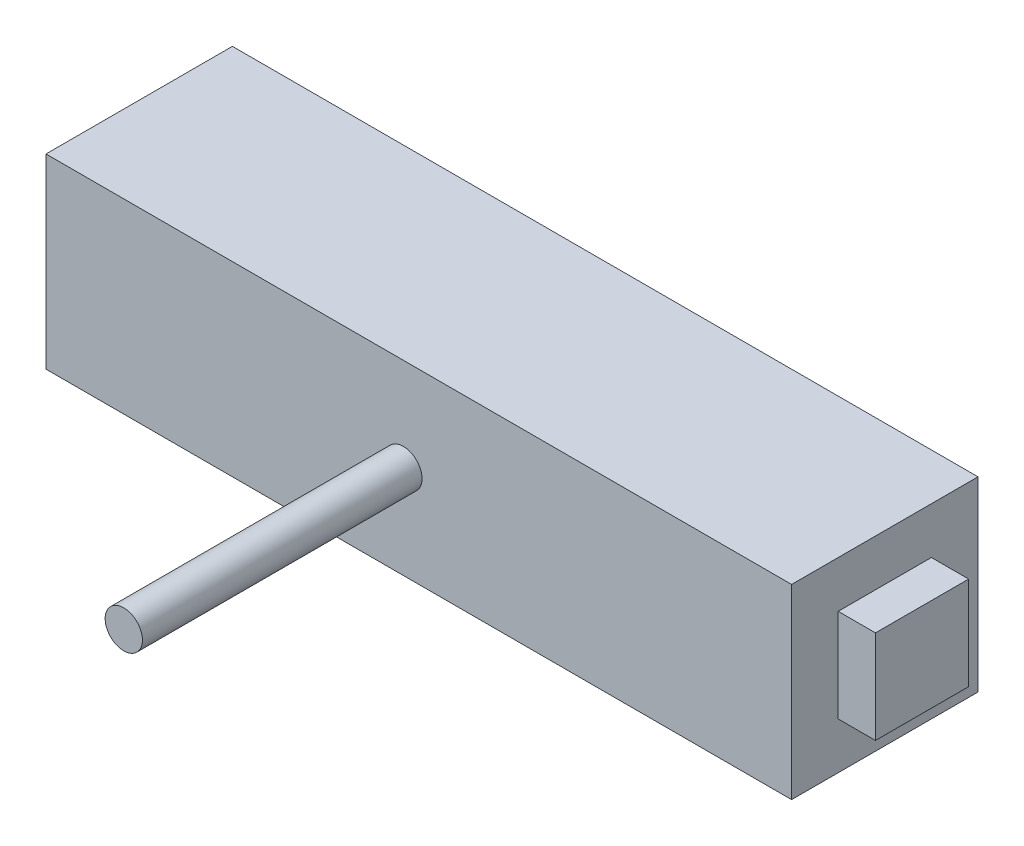
ISO-10303-21;
HEADER;
FILE_DESCRIPTION(('STEP AP214'),'2;1');
FILE_NAME('part.step','',(''),(''),'','','');
FILE_SCHEMA(('AUTOMOTIVE_DESIGN { 1 0 10303 214 1 1 1 1 }'));
ENDSEC;
DATA;
#1=APPLICATION_CONTEXT('core data for automotive mechanical design processes');
#2=APPLICATION_PROTOCOL_DEFINITION('international standard','automotive_design',2000,#1);
#3=PRODUCT_CONTEXT('',#1,'mechanical');
#4=PRODUCT('Part','Part','',(#3));
#5=PRODUCT_RELATED_PRODUCT_CATEGORY('part','',(#4));
#6=PRODUCT_DEFINITION_FORMATION('','',#4);
#7=PRODUCT_DEFINITION_CONTEXT('part definition',#1,'design');
#8=PRODUCT_DEFINITION('design','',#6,#7);
#9=PRODUCT_DEFINITION_SHAPE('','',#8);
#10=(LENGTH_UNIT() NAMED_UNIT(*) SI_UNIT(.MILLI.,.METRE.));
#11=(NAMED_UNIT(*) PLANE_ANGLE_UNIT() SI_UNIT($,.RADIAN.));
#12=(NAMED_UNIT(*) SI_UNIT($,.STERADIAN.) SOLID_ANGLE_UNIT());
#13=UNCERTAINTY_MEASURE_WITH_UNIT(LENGTH_MEASURE(1.E-05),#10,'distance_accuracy_value','');
#14=(GEOMETRIC_REPRESENTATION_CONTEXT(3) GLOBAL_UNCERTAINTY_ASSIGNED_CONTEXT((#13)) GLOBAL_UNIT_ASSIGNED_CONTEXT((#10,
#11,#12)) REPRESENTATION_CONTEXT('',''));
#15=CARTESIAN_POINT('',(0.,0.,0.));
#16=DIRECTION('',(0.,0.,1.));
#17=DIRECTION('',(1.,0.,0.));
#18=AXIS2_PLACEMENT_3D('',#15,#16,#17);
#19=CARTESIAN_POINT('',(50.8,25.4,-12.7));
#20=DIRECTION('',(-1.,0.,0.));
#21=DIRECTION('',(0.,0.,1.));
#22=AXIS2_PLACEMENT_3D('',#19,#20,#21);
#23=PLANE('',#22);
#24=DIRECTION('',(0.,0.,-1.));
#25=VECTOR('',#24,1.);
#26=CARTESIAN_POINT('',(50.8,0.,-12.7));
#27=LINE('',#26,#25);
#28=CARTESIAN_POINT('',(50.8,0.,12.7));
#29=VERTEX_POINT('',#28);
#30=CARTESIAN_POINT('',(50.8,0.,-12.7));
#31=VERTEX_POINT('',#30);
#32=EDGE_CURVE('E127',#29,#31,#27,.T.);
#33=ORIENTED_EDGE('',*,*,#32,.T.);
#34=DIRECTION('',(0.,-1.,0.));
#35=VECTOR('',#34,1.);
#36=CARTESIAN_POINT('',(50.8,25.4,-12.7));
#37=LINE('',#36,#35);
#38=CARTESIAN_POINT('',(50.8,25.4,-12.7));
#39=VERTEX_POINT('',#38);
#40=EDGE_CURVE('E47',#39,#31,#37,.T.);
#41=ORIENTED_EDGE('',*,*,#40,.F.);
#42=DIRECTION('',(0.,0.,-1.));
#43=VECTOR('',#42,1.);
#44=CARTESIAN_POINT('',(50.8,25.4,-12.7));
#45=LINE('',#44,#43);
#46=CARTESIAN_POINT('',(50.8,25.4,12.7));
#47=VERTEX_POINT('',#46);
#48=EDGE_CURVE('E138',#47,#39,#45,.T.);
#49=ORIENTED_EDGE('',*,*,#48,.F.);
#50=DIRECTION('',(0.,-1.,0.));
#51=VECTOR('',#50,1.);
#52=CARTESIAN_POINT('',(50.8,25.4,12.7));
#53=LINE('',#52,#51);
#54=EDGE_CURVE('E151',#47,#29,#53,.T.);
#55=ORIENTED_EDGE('',*,*,#54,.T.);
#56=EDGE_LOOP('',(#33,#41,#49,#55));
#57=FACE_BOUND('',#56,.T.);
#58=DIRECTION('',(0.,1.,0.));
#59=VECTOR('',#58,1.);
#60=CARTESIAN_POINT('',(50.8,19.05,-6.35));
#61=LINE('',#60,#59);
#62=CARTESIAN_POINT('',(50.8,6.35,-6.35));
#63=VERTEX_POINT('',#62);
#64=CARTESIAN_POINT('',(50.8,19.05,-6.35));
#65=VERTEX_POINT('',#64);
#66=EDGE_CURVE('E54',#63,#65,#61,.T.);
#67=ORIENTED_EDGE('',*,*,#66,.F.);
#68=DIRECTION('',(0.,0.,-1.));
#69=VECTOR('',#68,1.);
#70=CARTESIAN_POINT('',(50.8,6.35,6.35));
#71=LINE('',#70,#69);
#72=CARTESIAN_POINT('',(50.8,6.35,6.35));
#73=VERTEX_POINT('',#72);
#74=EDGE_CURVE('E58',#73,#63,#71,.T.);
#75=ORIENTED_EDGE('',*,*,#74,.F.);
#76=DIRECTION('',(0.,-1.,0.));
#77=VECTOR('',#76,1.);
#78=CARTESIAN_POINT('',(50.8,19.05,6.35));
#79=LINE('',#78,#77);
#80=CARTESIAN_POINT('',(50.8,19.05,6.35));
#81=VERTEX_POINT('',#80);
#82=EDGE_CURVE('E300',#81,#73,#79,.T.);
#83=ORIENTED_EDGE('',*,*,#82,.F.);
#84=DIRECTION('',(0.,0.,1.));
#85=VECTOR('',#84,1.);
#86=CARTESIAN_POINT('',(50.8,19.05,6.35));
#87=LINE('',#86,#85);
#88=EDGE_CURVE('E303',#65,#81,#87,.T.);
#89=ORIENTED_EDGE('',*,*,#88,.F.);
#90=EDGE_LOOP('',(#67,#75,#83,#89));
#91=FACE_BOUND('',#90,.T.);
#92=ADVANCED_FACE('F39',(#57,#91),#23,.F.);
#93=CARTESIAN_POINT('',(-50.8,25.4,-12.7));
#94=DIRECTION('',(0.,0.,1.));
#95=DIRECTION('',(1.,0.,0.));
#96=AXIS2_PLACEMENT_3D('',#93,#94,#95);
#97=PLANE('',#96);
#98=DIRECTION('',(-1.,0.,0.));
#99=VECTOR('',#98,1.);
#100=CARTESIAN_POINT('',(-50.8,0.,-12.7));
#101=LINE('',#100,#99);
#102=CARTESIAN_POINT('',(-50.8,0.,-12.7));
#103=VERTEX_POINT('',#102);
#104=EDGE_CURVE('E132',#31,#103,#101,.T.);
#105=ORIENTED_EDGE('',*,*,#104,.T.);
#106=DIRECTION('',(0.,-1.,0.));
#107=VECTOR('',#106,1.);
#108=CARTESIAN_POINT('',(-50.8,25.4,-12.7));
#109=LINE('',#108,#107);
#110=CARTESIAN_POINT('',(-50.8,25.4,-12.7));
#111=VERTEX_POINT('',#110);
#112=EDGE_CURVE('E167',#111,#103,#109,.T.);
#113=ORIENTED_EDGE('',*,*,#112,.F.);
#114=DIRECTION('',(-1.,0.,0.));
#115=VECTOR('',#114,1.);
#116=CARTESIAN_POINT('',(-50.8,25.4,-12.7));
#117=LINE('',#116,#115);
#118=EDGE_CURVE('E142',#39,#111,#117,.T.);
#119=ORIENTED_EDGE('',*,*,#118,.F.);
#120=ORIENTED_EDGE('',*,*,#40,.T.);
#121=EDGE_LOOP('',(#105,#113,#119,#120));
#122=FACE_BOUND('',#121,.T.);
#123=ADVANCED_FACE('F174',(#122),#97,.F.);
#124=CARTESIAN_POINT('',(-50.8,25.4,-12.7));
#125=DIRECTION('',(1.,0.,0.));
#126=DIRECTION('',(0.,0.,-1.));
#127=AXIS2_PLACEMENT_3D('',#124,#125,#126);
#128=PLANE('',#127);
#129=DIRECTION('',(0.,0.,1.));
#130=VECTOR('',#129,1.);
#131=CARTESIAN_POINT('',(-50.8,0.,-12.7));
#132=LINE('',#131,#130);
#133=CARTESIAN_POINT('',(-50.8,0.,12.7));
#134=VERTEX_POINT('',#133);
#135=EDGE_CURVE('E155',#103,#134,#132,.T.);
#136=ORIENTED_EDGE('',*,*,#135,.T.);
#137=DIRECTION('',(0.,-1.,0.));
#138=VECTOR('',#137,1.);
#139=CARTESIAN_POINT('',(-50.8,25.4,12.7));
#140=LINE('',#139,#138);
#141=CARTESIAN_POINT('',(-50.8,25.4,12.7));
#142=VERTEX_POINT('',#141);
#143=EDGE_CURVE('E163',#142,#134,#140,.T.);
#144=ORIENTED_EDGE('',*,*,#143,.F.);
#145=DIRECTION('',(0.,0.,1.));
#146=VECTOR('',#145,1.);
#147=CARTESIAN_POINT('',(-50.8,25.4,-12.7));
#148=LINE('',#147,#146);
#149=EDGE_CURVE('E146',#111,#142,#148,.T.);
#150=ORIENTED_EDGE('',*,*,#149,.F.);
#151=ORIENTED_EDGE('',*,*,#112,.T.);
#152=EDGE_LOOP('',(#136,#144,#150,#151));
#153=FACE_BOUND('',#152,.T.);
#154=ADVANCED_FACE('F186',(#153),#128,.F.);
#155=CARTESIAN_POINT('',(-50.8,25.4,12.7));
#156=DIRECTION('',(0.,0.,-1.));
#157=DIRECTION('',(-1.,0.,0.));
#158=AXIS2_PLACEMENT_3D('',#155,#156,#157);
#159=PLANE('',#158);
#160=CARTESIAN_POINT('',(-2.10107492424835,12.7,12.7));
#161=DIRECTION('',(0.,0.,-1.));
#162=DIRECTION('',(-1.,0.,0.));
#163=AXIS2_PLACEMENT_3D('',#160,#161,#162);
#164=CIRCLE('',#163,2.54);
#165=CARTESIAN_POINT('',(-4.64107492424835,12.7,12.7));
#166=VERTEX_POINT('',#165);
#167=EDGE_CURVE('E11',#166,#166,#164,.F.);
#168=ORIENTED_EDGE('',*,*,#167,.F.);
#169=EDGE_LOOP('',(#168));
#170=FACE_BOUND('',#169,.T.);
#171=DIRECTION('',(1.,0.,0.));
#172=VECTOR('',#171,1.);
#173=CARTESIAN_POINT('',(-50.8,0.,12.7));
#174=LINE('',#173,#172);
#175=EDGE_CURVE('E143',#134,#29,#174,.T.);
#176=ORIENTED_EDGE('',*,*,#175,.T.);
#177=ORIENTED_EDGE('',*,*,#54,.F.);
#178=DIRECTION('',(1.,0.,0.));
#179=VECTOR('',#178,1.);
#180=CARTESIAN_POINT('',(-50.8,25.4,12.7));
#181=LINE('',#180,#179);
#182=EDGE_CURVE('E149',#142,#47,#181,.T.);
#183=ORIENTED_EDGE('',*,*,#182,.F.);
#184=ORIENTED_EDGE('',*,*,#143,.T.);
#185=EDGE_LOOP('',(#176,#177,#183,#184));
#186=FACE_BOUND('',#185,.T.);
#187=ADVANCED_FACE('F190',(#170,#186),#159,.F.);
#188=CARTESIAN_POINT('',(0.,25.4,0.));
#189=DIRECTION('',(0.,1.,0.));
#190=DIRECTION('',(0.,0.,1.));
#191=AXIS2_PLACEMENT_3D('',#188,#189,#190);
#192=PLANE('',#191);
#193=ORIENTED_EDGE('',*,*,#48,.T.);
#194=ORIENTED_EDGE('',*,*,#118,.T.);
#195=ORIENTED_EDGE('',*,*,#149,.T.);
#196=ORIENTED_EDGE('',*,*,#182,.T.);
#197=EDGE_LOOP('',(#193,#194,#195,#196));
#198=FACE_BOUND('',#197,.T.);
#199=ADVANCED_FACE('F192',(#198),#192,.T.);
#200=CARTESIAN_POINT('',(0.,0.,0.));
#201=DIRECTION('',(0.,1.,0.));
#202=DIRECTION('',(0.,0.,1.));
#203=AXIS2_PLACEMENT_3D('',#200,#201,#202);
#204=PLANE('',#203);
#205=ORIENTED_EDGE('',*,*,#32,.F.);
#206=ORIENTED_EDGE('',*,*,#175,.F.);
#207=ORIENTED_EDGE('',*,*,#135,.F.);
#208=ORIENTED_EDGE('',*,*,#104,.F.);
#209=EDGE_LOOP('',(#205,#206,#207,#208));
#210=FACE_BOUND('',#209,.T.);
#211=ADVANCED_FACE('F182',(#210),#204,.F.);
#212=CARTESIAN_POINT('',(55.88,19.05,-6.35));
#213=DIRECTION('',(0.,0.,1.));
#214=DIRECTION('',(0.,-1.,0.));
#215=AXIS2_PLACEMENT_3D('',#212,#213,#214);
#216=PLANE('',#215);
#217=ORIENTED_EDGE('',*,*,#66,.T.);
#218=DIRECTION('',(-1.,0.,0.));
#219=VECTOR('',#218,1.);
#220=CARTESIAN_POINT('',(55.88,19.05,-6.35));
#221=LINE('',#220,#219);
#222=CARTESIAN_POINT('',(55.88,19.05,-6.35));
#223=VERTEX_POINT('',#222);
#224=EDGE_CURVE('E107',#223,#65,#221,.T.);
#225=ORIENTED_EDGE('',*,*,#224,.F.);
#226=DIRECTION('',(0.,1.,0.));
#227=VECTOR('',#226,1.);
#228=CARTESIAN_POINT('',(55.88,19.05,-6.35));
#229=LINE('',#228,#227);
#230=CARTESIAN_POINT('',(55.88,6.35,-6.35));
#231=VERTEX_POINT('',#230);
#232=EDGE_CURVE('E114',#231,#223,#229,.T.);
#233=ORIENTED_EDGE('',*,*,#232,.F.);
#234=DIRECTION('',(-1.,0.,0.));
#235=VECTOR('',#234,1.);
#236=CARTESIAN_POINT('',(55.88,6.35,-6.35));
#237=LINE('',#236,#235);
#238=EDGE_CURVE('E306',#231,#63,#237,.T.);
#239=ORIENTED_EDGE('',*,*,#238,.T.);
#240=EDGE_LOOP('',(#217,#225,#233,#239));
#241=FACE_BOUND('',#240,.T.);
#242=ADVANCED_FACE('F125',(#241),#216,.F.);
#243=CARTESIAN_POINT('',(55.88,19.05,6.35));
#244=DIRECTION('',(0.,-1.,0.));
#245=DIRECTION('',(0.,0.,-1.));
#246=AXIS2_PLACEMENT_3D('',#243,#244,#245);
#247=PLANE('',#246);
#248=ORIENTED_EDGE('',*,*,#88,.T.);
#249=DIRECTION('',(-1.,0.,0.));
#250=VECTOR('',#249,1.);
#251=CARTESIAN_POINT('',(55.88,19.05,6.35));
#252=LINE('',#251,#250);
#253=CARTESIAN_POINT('',(55.88,19.05,6.35));
#254=VERTEX_POINT('',#253);
#255=EDGE_CURVE('E109',#254,#81,#252,.T.);
#256=ORIENTED_EDGE('',*,*,#255,.F.);
#257=DIRECTION('',(0.,0.,1.));
#258=VECTOR('',#257,1.);
#259=CARTESIAN_POINT('',(55.88,19.05,6.35));
#260=LINE('',#259,#258);
#261=EDGE_CURVE('E102',#223,#254,#260,.T.);
#262=ORIENTED_EDGE('',*,*,#261,.F.);
#263=ORIENTED_EDGE('',*,*,#224,.T.);
#264=EDGE_LOOP('',(#248,#256,#262,#263));
#265=FACE_BOUND('',#264,.T.);
#266=ADVANCED_FACE('F105',(#265),#247,.F.);
#267=CARTESIAN_POINT('',(55.88,19.05,6.35));
#268=DIRECTION('',(0.,0.,-1.));
#269=DIRECTION('',(0.,1.,0.));
#270=AXIS2_PLACEMENT_3D('',#267,#268,#269);
#271=PLANE('',#270);
#272=ORIENTED_EDGE('',*,*,#82,.T.);
#273=DIRECTION('',(-1.,0.,0.));
#274=VECTOR('',#273,1.);
#275=CARTESIAN_POINT('',(55.88,6.35,6.35));
#276=LINE('',#275,#274);
#277=CARTESIAN_POINT('',(55.88,6.35,6.35));
#278=VERTEX_POINT('',#277);
#279=EDGE_CURVE('E134',#278,#73,#276,.T.);
#280=ORIENTED_EDGE('',*,*,#279,.F.);
#281=DIRECTION('',(0.,-1.,0.));
#282=VECTOR('',#281,1.);
#283=CARTESIAN_POINT('',(55.88,19.05,6.35));
#284=LINE('',#283,#282);
#285=EDGE_CURVE('E113',#254,#278,#284,.T.);
#286=ORIENTED_EDGE('',*,*,#285,.F.);
#287=ORIENTED_EDGE('',*,*,#255,.T.);
#288=EDGE_LOOP('',(#272,#280,#286,#287));
#289=FACE_BOUND('',#288,.T.);
#290=ADVANCED_FACE('F253',(#289),#271,.F.);
#291=CARTESIAN_POINT('',(55.88,6.35,6.35));
#292=DIRECTION('',(0.,1.,0.));
#293=DIRECTION('',(0.,0.,1.));
#294=AXIS2_PLACEMENT_3D('',#291,#292,#293);
#295=PLANE('',#294);
#296=ORIENTED_EDGE('',*,*,#74,.T.);
#297=ORIENTED_EDGE('',*,*,#238,.F.);
#298=DIRECTION('',(0.,0.,-1.));
#299=VECTOR('',#298,1.);
#300=CARTESIAN_POINT('',(55.88,6.35,6.35));
#301=LINE('',#300,#299);
#302=EDGE_CURVE('E119',#278,#231,#301,.T.);
#303=ORIENTED_EDGE('',*,*,#302,.F.);
#304=ORIENTED_EDGE('',*,*,#279,.T.);
#305=EDGE_LOOP('',(#296,#297,#303,#304));
#306=FACE_BOUND('',#305,.T.);
#307=ADVANCED_FACE('F250',(#306),#295,.F.);
#308=CARTESIAN_POINT('',(55.88,0.,0.));
#309=DIRECTION('',(1.,0.,0.));
#310=DIRECTION('',(0.,0.,-1.));
#311=AXIS2_PLACEMENT_3D('',#308,#309,#310);
#312=PLANE('',#311);
#313=ORIENTED_EDGE('',*,*,#232,.T.);
#314=ORIENTED_EDGE('',*,*,#261,.T.);
#315=ORIENTED_EDGE('',*,*,#285,.T.);
#316=ORIENTED_EDGE('',*,*,#302,.T.);
#317=EDGE_LOOP('',(#313,#314,#315,#316));
#318=FACE_BOUND('',#317,.T.);
#319=ADVANCED_FACE('F117',(#318),#312,.T.);
#320=CARTESIAN_POINT('',(-2.10107492424835,12.7,50.8));
#321=DIRECTION('',(0.,0.,-1.));
#322=DIRECTION('',(-1.,0.,0.));
#323=AXIS2_PLACEMENT_3D('',#320,#321,#322);
#324=CYLINDRICAL_SURFACE('',#323,2.54);
#325=CARTESIAN_POINT('',(-2.10107492424835,12.7,50.8));
#326=DIRECTION('',(0.,0.,1.));
#327=DIRECTION('',(1.,0.,0.));
#328=AXIS2_PLACEMENT_3D('',#325,#326,#327);
#329=CIRCLE('',#328,2.54);
#330=CARTESIAN_POINT('',(0.438925075751648,12.7,50.8));
#331=VERTEX_POINT('',#330);
#332=EDGE_CURVE('E316',#331,#331,#329,.T.);
#333=ORIENTED_EDGE('',*,*,#332,.F.);
#334=EDGE_LOOP('',(#333));
#335=FACE_BOUND('',#334,.T.);
#336=ORIENTED_EDGE('',*,*,#167,.T.);
#337=EDGE_LOOP('',(#336));
#338=FACE_BOUND('',#337,.T.);
#339=ADVANCED_FACE('F228',(#335,#338),#324,.T.);
#340=CARTESIAN_POINT('',(-2.10107492424835,12.7,50.8));
#341=DIRECTION('',(0.,0.,1.));
#342=DIRECTION('',(1.,0.,0.));
#343=AXIS2_PLACEMENT_3D('',#340,#341,#342);
#344=PLANE('',#343);
#345=ORIENTED_EDGE('',*,*,#332,.T.);
#346=EDGE_LOOP('',(#345));
#347=FACE_BOUND('',#346,.T.);
#348=ADVANCED_FACE('F233',(#347),#344,.T.);
#349=CLOSED_SHELL('',(#92,#123,#154,#187,#199,#211,#242,#266,#290,#307,#319,#339,#348));
#350=MANIFOLD_SOLID_BREP('B2',#349);
#351=ADVANCED_BREP_SHAPE_REPRESENTATION('',(#18,#350),#14);
#352=SHAPE_DEFINITION_REPRESENTATION(#9,#351);
ENDSEC;
END-ISO-10303-21;
